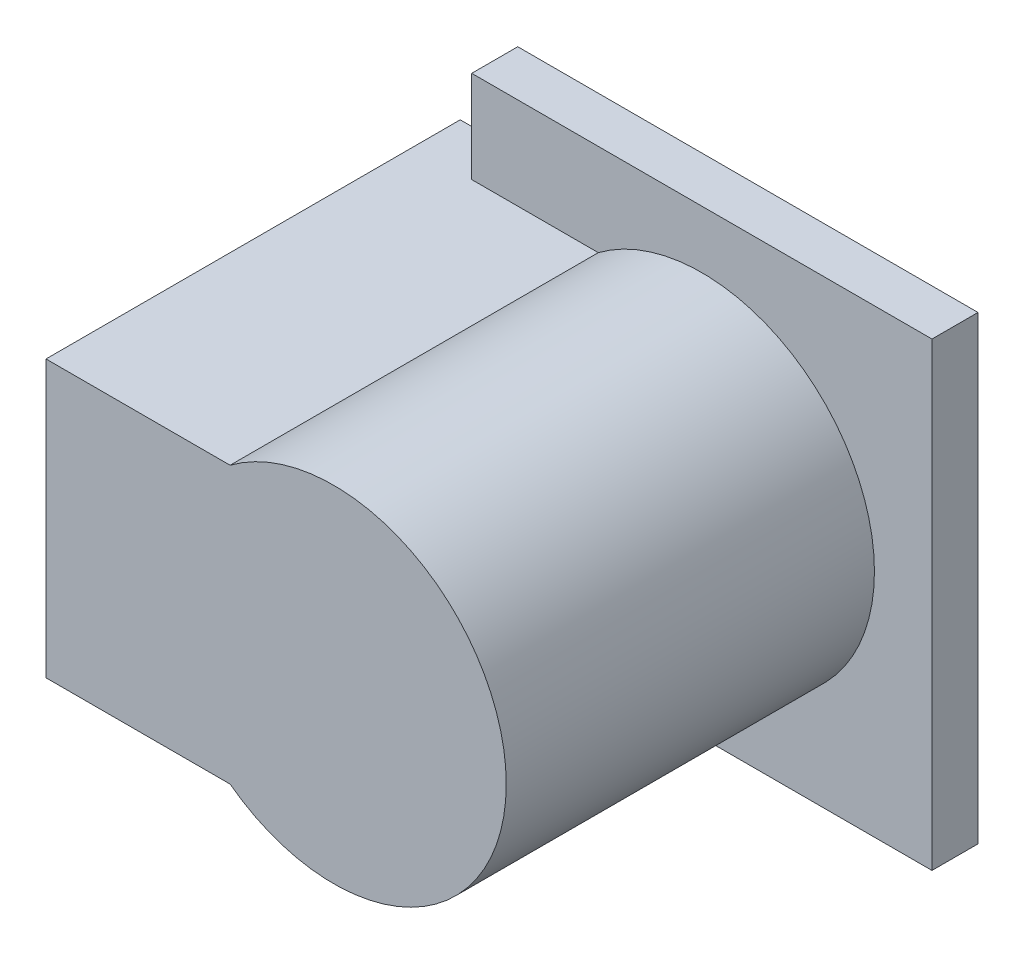
ISO-10303-21;
HEADER;
FILE_DESCRIPTION(('STEP AP214'),'2;1');
FILE_NAME('part.step','',(''),(''),'','','');
FILE_SCHEMA(('AUTOMOTIVE_DESIGN { 1 0 10303 214 1 1 1 1 }'));
ENDSEC;
DATA;
#1=APPLICATION_CONTEXT('core data for automotive mechanical design processes');
#2=APPLICATION_PROTOCOL_DEFINITION('international standard','automotive_design',2000,#1);
#3=PRODUCT_CONTEXT('',#1,'mechanical');
#4=PRODUCT('Part','Part','',(#3));
#5=PRODUCT_RELATED_PRODUCT_CATEGORY('part','',(#4));
#6=PRODUCT_DEFINITION_FORMATION('','',#4);
#7=PRODUCT_DEFINITION_CONTEXT('part definition',#1,'design');
#8=PRODUCT_DEFINITION('design','',#6,#7);
#9=PRODUCT_DEFINITION_SHAPE('','',#8);
#10=(LENGTH_UNIT() NAMED_UNIT(*) SI_UNIT(.MILLI.,.METRE.));
#11=(NAMED_UNIT(*) PLANE_ANGLE_UNIT() SI_UNIT($,.RADIAN.));
#12=(NAMED_UNIT(*) SI_UNIT($,.STERADIAN.) SOLID_ANGLE_UNIT());
#13=UNCERTAINTY_MEASURE_WITH_UNIT(LENGTH_MEASURE(1.E-05),#10,'distance_accuracy_value','');
#14=(GEOMETRIC_REPRESENTATION_CONTEXT(3) GLOBAL_UNCERTAINTY_ASSIGNED_CONTEXT((#13)) GLOBAL_UNIT_ASSIGNED_CONTEXT((#10,
#11,#12)) REPRESENTATION_CONTEXT('',''));
#15=CARTESIAN_POINT('',(0.,0.,0.));
#16=DIRECTION('',(0.,0.,1.));
#17=DIRECTION('',(1.,0.,0.));
#18=AXIS2_PLACEMENT_3D('',#15,#16,#17);
#19=CARTESIAN_POINT('',(-37.64989654809,0.,180.));
#20=DIRECTION('',(0.,0.,1.));
#21=DIRECTION('',(1.,0.,0.));
#22=AXIS2_PLACEMENT_3D('',#19,#20,#21);
#23=PLANE('',#22);
#24=CARTESIAN_POINT('',(0.,0.,180.));
#25=DIRECTION('',(0.,0.,1.));
#26=DIRECTION('',(1.,0.,0.));
#27=AXIS2_PLACEMENT_3D('',#24,#25,#26);
#28=CIRCLE('',#27,75.);
#29=CARTESIAN_POINT('',(-45.,-60.,180.));
#30=VERTEX_POINT('',#29);
#31=CARTESIAN_POINT('',(-45.,60.,180.));
#32=VERTEX_POINT('',#31);
#33=EDGE_CURVE('E11',#30,#32,#28,.T.);
#34=ORIENTED_EDGE('',*,*,#33,.T.);
#35=DIRECTION('',(-1.,0.,0.));
#36=VECTOR('',#35,1.);
#37=CARTESIAN_POINT('',(-45.,60.,180.));
#38=LINE('',#37,#36);
#39=CARTESIAN_POINT('',(-125.,60.,180.));
#40=VERTEX_POINT('',#39);
#41=EDGE_CURVE('E237',#32,#40,#38,.T.);
#42=ORIENTED_EDGE('',*,*,#41,.T.);
#43=DIRECTION('',(0.,-1.,0.));
#44=VECTOR('',#43,1.);
#45=CARTESIAN_POINT('',(-125.,60.,180.));
#46=LINE('',#45,#44);
#47=CARTESIAN_POINT('',(-125.,-60.,180.));
#48=VERTEX_POINT('',#47);
#49=EDGE_CURVE('E252',#40,#48,#46,.T.);
#50=ORIENTED_EDGE('',*,*,#49,.T.);
#51=DIRECTION('',(1.,0.,0.));
#52=VECTOR('',#51,1.);
#53=CARTESIAN_POINT('',(-125.,-60.,180.));
#54=LINE('',#53,#52);
#55=EDGE_CURVE('E226',#48,#30,#54,.T.);
#56=ORIENTED_EDGE('',*,*,#55,.T.);
#57=EDGE_LOOP('',(#34,#42,#50,#56));
#58=FACE_BOUND('',#57,.T.);
#59=ADVANCED_FACE('F19',(#58),#23,.T.);
#60=CARTESIAN_POINT('',(0.,0.,0.));
#61=DIRECTION('',(0.,0.,-1.));
#62=DIRECTION('',(1.,0.,0.));
#63=AXIS2_PLACEMENT_3D('',#60,#61,#62);
#64=CYLINDRICAL_SURFACE('',#63,75.);
#65=DIRECTION('',(0.,0.,1.));
#66=VECTOR('',#65,1.);
#67=CARTESIAN_POINT('',(-45.,60.,0.));
#68=LINE('',#67,#66);
#69=CARTESIAN_POINT('',(-45.,60.,20.));
#70=VERTEX_POINT('',#69);
#71=EDGE_CURVE('E203',#70,#32,#68,.T.);
#72=ORIENTED_EDGE('',*,*,#71,.T.);
#73=ORIENTED_EDGE('',*,*,#33,.F.);
#74=DIRECTION('',(0.,0.,1.));
#75=VECTOR('',#74,1.);
#76=CARTESIAN_POINT('',(-45.,-60.,0.));
#77=LINE('',#76,#75);
#78=CARTESIAN_POINT('',(-45.,-60.,20.));
#79=VERTEX_POINT('',#78);
#80=EDGE_CURVE('E222',#79,#30,#77,.T.);
#81=ORIENTED_EDGE('',*,*,#80,.F.);
#82=CARTESIAN_POINT('',(0.,0.,20.));
#83=DIRECTION('',(0.,0.,-1.));
#84=DIRECTION('',(1.,0.,0.));
#85=AXIS2_PLACEMENT_3D('',#82,#83,#84);
#86=CIRCLE('',#85,75.);
#87=EDGE_CURVE('E30',#70,#79,#86,.T.);
#88=ORIENTED_EDGE('',*,*,#87,.F.);
#89=EDGE_LOOP('',(#72,#73,#81,#88));
#90=FACE_BOUND('',#89,.T.);
#91=ADVANCED_FACE('F279',(#90),#64,.T.);
#92=CARTESIAN_POINT('',(0.,0.,20.));
#93=DIRECTION('',(0.,0.,-1.));
#94=DIRECTION('',(0.,-1.,0.));
#95=AXIS2_PLACEMENT_3D('',#92,#93,#94);
#96=PLANE('',#95);
#97=DIRECTION('',(1.,0.,0.));
#98=VECTOR('',#97,1.);
#99=CARTESIAN_POINT('',(-22.5,60.,20.));
#100=LINE('',#99,#98);
#101=CARTESIAN_POINT('',(-100.,60.,20.));
#102=VERTEX_POINT('',#101);
#103=EDGE_CURVE('E241',#102,#70,#100,.T.);
#104=ORIENTED_EDGE('',*,*,#103,.T.);
#105=ORIENTED_EDGE('',*,*,#87,.T.);
#106=DIRECTION('',(-1.,0.,0.));
#107=VECTOR('',#106,1.);
#108=CARTESIAN_POINT('',(-62.5,-60.,20.));
#109=LINE('',#108,#107);
#110=CARTESIAN_POINT('',(-100.,-60.,20.));
#111=VERTEX_POINT('',#110);
#112=EDGE_CURVE('E116',#79,#111,#109,.T.);
#113=ORIENTED_EDGE('',*,*,#112,.T.);
#114=DIRECTION('',(0.,1.,0.));
#115=VECTOR('',#114,1.);
#116=CARTESIAN_POINT('',(-100.,-100.,20.));
#117=LINE('',#116,#115);
#118=CARTESIAN_POINT('',(-100.,-100.,20.));
#119=VERTEX_POINT('',#118);
#120=EDGE_CURVE('E157',#119,#111,#117,.T.);
#121=ORIENTED_EDGE('',*,*,#120,.F.);
#122=DIRECTION('',(-1.,0.,0.));
#123=VECTOR('',#122,1.);
#124=CARTESIAN_POINT('',(100.,-100.,20.));
#125=LINE('',#124,#123);
#126=CARTESIAN_POINT('',(100.,-100.,20.));
#127=VERTEX_POINT('',#126);
#128=EDGE_CURVE('E123',#127,#119,#125,.T.);
#129=ORIENTED_EDGE('',*,*,#128,.F.);
#130=DIRECTION('',(0.,-1.,0.));
#131=VECTOR('',#130,1.);
#132=CARTESIAN_POINT('',(100.,100.,20.));
#133=LINE('',#132,#131);
#134=CARTESIAN_POINT('',(100.,100.,20.));
#135=VERTEX_POINT('',#134);
#136=EDGE_CURVE('E256',#135,#127,#133,.T.);
#137=ORIENTED_EDGE('',*,*,#136,.F.);
#138=DIRECTION('',(1.,0.,0.));
#139=VECTOR('',#138,1.);
#140=CARTESIAN_POINT('',(-100.,100.,20.));
#141=LINE('',#140,#139);
#142=CARTESIAN_POINT('',(-100.,100.,20.));
#143=VERTEX_POINT('',#142);
#144=EDGE_CURVE('E223',#143,#135,#141,.T.);
#145=ORIENTED_EDGE('',*,*,#144,.F.);
#146=DIRECTION('',(0.,1.,0.));
#147=VECTOR('',#146,1.);
#148=CARTESIAN_POINT('',(-100.,-100.,20.));
#149=LINE('',#148,#147);
#150=EDGE_CURVE('E210',#102,#143,#149,.T.);
#151=ORIENTED_EDGE('',*,*,#150,.F.);
#152=EDGE_LOOP('',(#104,#105,#113,#121,#129,#137,#145,#151));
#153=FACE_BOUND('',#152,.T.);
#154=ADVANCED_FACE('F301',(#153),#96,.F.);
#155=CARTESIAN_POINT('',(-45.,60.,0.));
#156=DIRECTION('',(0.,-1.,0.));
#157=DIRECTION('',(0.,0.,-1.));
#158=AXIS2_PLACEMENT_3D('',#155,#156,#157);
#159=PLANE('',#158);
#160=DIRECTION('',(0.,0.,-1.));
#161=VECTOR('',#160,1.);
#162=CARTESIAN_POINT('',(-100.,60.,0.));
#163=LINE('',#162,#161);
#164=CARTESIAN_POINT('',(-100.,60.,0.));
#165=VERTEX_POINT('',#164);
#166=EDGE_CURVE('E145',#102,#165,#163,.T.);
#167=ORIENTED_EDGE('',*,*,#166,.T.);
#168=DIRECTION('',(-1.,0.,0.));
#169=VECTOR('',#168,1.);
#170=CARTESIAN_POINT('',(-45.,60.,0.));
#171=LINE('',#170,#169);
#172=CARTESIAN_POINT('',(-125.,60.,0.));
#173=VERTEX_POINT('',#172);
#174=EDGE_CURVE('E171',#165,#173,#171,.T.);
#175=ORIENTED_EDGE('',*,*,#174,.T.);
#176=DIRECTION('',(0.,0.,1.));
#177=VECTOR('',#176,1.);
#178=CARTESIAN_POINT('',(-125.,60.,0.));
#179=LINE('',#178,#177);
#180=EDGE_CURVE('E239',#173,#40,#179,.T.);
#181=ORIENTED_EDGE('',*,*,#180,.T.);
#182=ORIENTED_EDGE('',*,*,#41,.F.);
#183=ORIENTED_EDGE('',*,*,#71,.F.);
#184=ORIENTED_EDGE('',*,*,#103,.F.);
#185=EDGE_LOOP('',(#167,#175,#181,#182,#183,#184));
#186=FACE_BOUND('',#185,.T.);
#187=ADVANCED_FACE('F306',(#186),#159,.F.);
#188=CARTESIAN_POINT('',(-125.,60.,0.));
#189=DIRECTION('',(1.,0.,0.));
#190=DIRECTION('',(0.,1.,0.));
#191=AXIS2_PLACEMENT_3D('',#188,#189,#190);
#192=PLANE('',#191);
#193=DIRECTION('',(0.,-1.,0.));
#194=VECTOR('',#193,1.);
#195=CARTESIAN_POINT('',(-125.,60.,0.));
#196=LINE('',#195,#194);
#197=CARTESIAN_POINT('',(-125.,-60.,0.));
#198=VERTEX_POINT('',#197);
#199=EDGE_CURVE('E182',#173,#198,#196,.T.);
#200=ORIENTED_EDGE('',*,*,#199,.T.);
#201=DIRECTION('',(0.,0.,1.));
#202=VECTOR('',#201,1.);
#203=CARTESIAN_POINT('',(-125.,-60.,0.));
#204=LINE('',#203,#202);
#205=EDGE_CURVE('E23',#198,#48,#204,.T.);
#206=ORIENTED_EDGE('',*,*,#205,.T.);
#207=ORIENTED_EDGE('',*,*,#49,.F.);
#208=ORIENTED_EDGE('',*,*,#180,.F.);
#209=EDGE_LOOP('',(#200,#206,#207,#208));
#210=FACE_BOUND('',#209,.T.);
#211=ADVANCED_FACE('F286',(#210),#192,.F.);
#212=CARTESIAN_POINT('',(-125.,-60.,0.));
#213=DIRECTION('',(0.,1.,0.));
#214=DIRECTION('',(1.,0.,0.));
#215=AXIS2_PLACEMENT_3D('',#212,#213,#214);
#216=PLANE('',#215);
#217=DIRECTION('',(0.,0.,1.));
#218=VECTOR('',#217,1.);
#219=CARTESIAN_POINT('',(-100.,-60.,0.));
#220=LINE('',#219,#218);
#221=CARTESIAN_POINT('',(-100.,-60.,0.));
#222=VERTEX_POINT('',#221);
#223=EDGE_CURVE('E151',#222,#111,#220,.T.);
#224=ORIENTED_EDGE('',*,*,#223,.T.);
#225=ORIENTED_EDGE('',*,*,#112,.F.);
#226=ORIENTED_EDGE('',*,*,#80,.T.);
#227=ORIENTED_EDGE('',*,*,#55,.F.);
#228=ORIENTED_EDGE('',*,*,#205,.F.);
#229=DIRECTION('',(1.,0.,0.));
#230=VECTOR('',#229,1.);
#231=CARTESIAN_POINT('',(-125.,-60.,0.));
#232=LINE('',#231,#230);
#233=EDGE_CURVE('E162',#198,#222,#232,.T.);
#234=ORIENTED_EDGE('',*,*,#233,.T.);
#235=EDGE_LOOP('',(#224,#225,#226,#227,#228,#234));
#236=FACE_BOUND('',#235,.T.);
#237=ADVANCED_FACE('F163',(#236),#216,.F.);
#238=CARTESIAN_POINT('',(-100.,100.,0.));
#239=DIRECTION('',(0.,1.,0.));
#240=DIRECTION('',(1.,0.,0.));
#241=AXIS2_PLACEMENT_3D('',#238,#239,#240);
#242=PLANE('',#241);
#243=DIRECTION('',(0.,0.,1.));
#244=VECTOR('',#243,1.);
#245=CARTESIAN_POINT('',(-100.,100.,0.));
#246=LINE('',#245,#244);
#247=CARTESIAN_POINT('',(-100.,100.,0.));
#248=VERTEX_POINT('',#247);
#249=EDGE_CURVE('E214',#248,#143,#246,.T.);
#250=ORIENTED_EDGE('',*,*,#249,.T.);
#251=ORIENTED_EDGE('',*,*,#144,.T.);
#252=DIRECTION('',(0.,0.,1.));
#253=VECTOR('',#252,1.);
#254=CARTESIAN_POINT('',(100.,100.,0.));
#255=LINE('',#254,#253);
#256=CARTESIAN_POINT('',(100.,100.,0.));
#257=VERTEX_POINT('',#256);
#258=EDGE_CURVE('E235',#257,#135,#255,.T.);
#259=ORIENTED_EDGE('',*,*,#258,.F.);
#260=DIRECTION('',(1.,0.,0.));
#261=VECTOR('',#260,1.);
#262=CARTESIAN_POINT('',(-100.,100.,0.));
#263=LINE('',#262,#261);
#264=EDGE_CURVE('E209',#248,#257,#263,.T.);
#265=ORIENTED_EDGE('',*,*,#264,.F.);
#266=EDGE_LOOP('',(#250,#251,#259,#265));
#267=FACE_BOUND('',#266,.T.);
#268=ADVANCED_FACE('F350',(#267),#242,.T.);
#269=CARTESIAN_POINT('',(100.,100.,0.));
#270=DIRECTION('',(1.,0.,0.));
#271=DIRECTION('',(0.,1.,0.));
#272=AXIS2_PLACEMENT_3D('',#269,#270,#271);
#273=PLANE('',#272);
#274=ORIENTED_EDGE('',*,*,#258,.T.);
#275=ORIENTED_EDGE('',*,*,#136,.T.);
#276=DIRECTION('',(0.,0.,1.));
#277=VECTOR('',#276,1.);
#278=CARTESIAN_POINT('',(100.,-100.,0.));
#279=LINE('',#278,#277);
#280=CARTESIAN_POINT('',(100.,-100.,0.));
#281=VERTEX_POINT('',#280);
#282=EDGE_CURVE('E103',#281,#127,#279,.T.);
#283=ORIENTED_EDGE('',*,*,#282,.F.);
#284=DIRECTION('',(0.,-1.,0.));
#285=VECTOR('',#284,1.);
#286=CARTESIAN_POINT('',(100.,100.,0.));
#287=LINE('',#286,#285);
#288=EDGE_CURVE('E206',#257,#281,#287,.T.);
#289=ORIENTED_EDGE('',*,*,#288,.F.);
#290=EDGE_LOOP('',(#274,#275,#283,#289));
#291=FACE_BOUND('',#290,.T.);
#292=ADVANCED_FACE('F344',(#291),#273,.T.);
#293=CARTESIAN_POINT('',(100.,-100.,0.));
#294=DIRECTION('',(0.,-1.,0.));
#295=DIRECTION('',(0.,0.,-1.));
#296=AXIS2_PLACEMENT_3D('',#293,#294,#295);
#297=PLANE('',#296);
#298=ORIENTED_EDGE('',*,*,#282,.T.);
#299=ORIENTED_EDGE('',*,*,#128,.T.);
#300=DIRECTION('',(0.,0.,1.));
#301=VECTOR('',#300,1.);
#302=CARTESIAN_POINT('',(-100.,-100.,0.));
#303=LINE('',#302,#301);
#304=CARTESIAN_POINT('',(-100.,-100.,0.));
#305=VERTEX_POINT('',#304);
#306=EDGE_CURVE('E91',#305,#119,#303,.T.);
#307=ORIENTED_EDGE('',*,*,#306,.F.);
#308=DIRECTION('',(-1.,0.,0.));
#309=VECTOR('',#308,1.);
#310=CARTESIAN_POINT('',(100.,-100.,0.));
#311=LINE('',#310,#309);
#312=EDGE_CURVE('E180',#281,#305,#311,.T.);
#313=ORIENTED_EDGE('',*,*,#312,.F.);
#314=EDGE_LOOP('',(#298,#299,#307,#313));
#315=FACE_BOUND('',#314,.T.);
#316=ADVANCED_FACE('F349',(#315),#297,.T.);
#317=CARTESIAN_POINT('',(-100.,-100.,0.));
#318=DIRECTION('',(-1.,0.,0.));
#319=DIRECTION('',(0.,0.,1.));
#320=AXIS2_PLACEMENT_3D('',#317,#318,#319);
#321=PLANE('',#320);
#322=DIRECTION('',(0.,1.,0.));
#323=VECTOR('',#322,1.);
#324=CARTESIAN_POINT('',(-100.,-100.,0.));
#325=LINE('',#324,#323);
#326=EDGE_CURVE('E155',#305,#222,#325,.T.);
#327=ORIENTED_EDGE('',*,*,#326,.F.);
#328=ORIENTED_EDGE('',*,*,#306,.T.);
#329=ORIENTED_EDGE('',*,*,#120,.T.);
#330=ORIENTED_EDGE('',*,*,#223,.F.);
#331=EDGE_LOOP('',(#327,#328,#329,#330));
#332=FACE_BOUND('',#331,.T.);
#333=ADVANCED_FACE('F153',(#332),#321,.T.);
#334=CARTESIAN_POINT('',(-100.,-100.,0.));
#335=DIRECTION('',(-1.,0.,0.));
#336=DIRECTION('',(0.,0.,1.));
#337=AXIS2_PLACEMENT_3D('',#334,#335,#336);
#338=PLANE('',#337);
#339=DIRECTION('',(0.,1.,0.));
#340=VECTOR('',#339,1.);
#341=CARTESIAN_POINT('',(-100.,-100.,0.));
#342=LINE('',#341,#340);
#343=EDGE_CURVE('E190',#165,#248,#342,.T.);
#344=ORIENTED_EDGE('',*,*,#343,.F.);
#345=ORIENTED_EDGE('',*,*,#166,.F.);
#346=ORIENTED_EDGE('',*,*,#150,.T.);
#347=ORIENTED_EDGE('',*,*,#249,.F.);
#348=EDGE_LOOP('',(#344,#345,#346,#347));
#349=FACE_BOUND('',#348,.T.);
#350=ADVANCED_FACE('F293',(#349),#338,.T.);
#351=CARTESIAN_POINT('',(-37.64989654809,0.,0.));
#352=DIRECTION('',(0.,0.,1.));
#353=DIRECTION('',(1.,0.,0.));
#354=AXIS2_PLACEMENT_3D('',#351,#352,#353);
#355=PLANE('',#354);
#356=ORIENTED_EDGE('',*,*,#199,.F.);
#357=ORIENTED_EDGE('',*,*,#174,.F.);
#358=DIRECTION('',(0.,1.,0.));
#359=VECTOR('',#358,1.);
#360=CARTESIAN_POINT('',(-100.,-100.,0.));
#361=LINE('',#360,#359);
#362=EDGE_CURVE('E187',#222,#165,#361,.T.);
#363=ORIENTED_EDGE('',*,*,#362,.F.);
#364=ORIENTED_EDGE('',*,*,#233,.F.);
#365=EDGE_LOOP('',(#356,#357,#363,#364));
#366=FACE_BOUND('',#365,.T.);
#367=ADVANCED_FACE('F192',(#366),#355,.F.);
#368=CARTESIAN_POINT('',(0.,0.,0.));
#369=DIRECTION('',(0.,0.,-1.));
#370=DIRECTION('',(0.,-1.,0.));
#371=AXIS2_PLACEMENT_3D('',#368,#369,#370);
#372=PLANE('',#371);
#373=ORIENTED_EDGE('',*,*,#343,.T.);
#374=ORIENTED_EDGE('',*,*,#264,.T.);
#375=ORIENTED_EDGE('',*,*,#288,.T.);
#376=ORIENTED_EDGE('',*,*,#312,.T.);
#377=ORIENTED_EDGE('',*,*,#326,.T.);
#378=DIRECTION('',(1.,0.,0.));
#379=VECTOR('',#378,1.);
#380=CARTESIAN_POINT('',(-125.,-60.,0.));
#381=LINE('',#380,#379);
#382=CARTESIAN_POINT('',(-45.,-60.,0.));
#383=VERTEX_POINT('',#382);
#384=EDGE_CURVE('E177',#222,#383,#381,.T.);
#385=ORIENTED_EDGE('',*,*,#384,.T.);
#386=CARTESIAN_POINT('',(0.,0.,0.));
#387=DIRECTION('',(0.,0.,1.));
#388=DIRECTION('',(1.,0.,0.));
#389=AXIS2_PLACEMENT_3D('',#386,#387,#388);
#390=CIRCLE('',#389,75.);
#391=CARTESIAN_POINT('',(-45.,60.,0.));
#392=VERTEX_POINT('',#391);
#393=EDGE_CURVE('E188',#383,#392,#390,.T.);
#394=ORIENTED_EDGE('',*,*,#393,.T.);
#395=DIRECTION('',(-1.,0.,0.));
#396=VECTOR('',#395,1.);
#397=CARTESIAN_POINT('',(-45.,60.,0.));
#398=LINE('',#397,#396);
#399=EDGE_CURVE('E195',#392,#165,#398,.T.);
#400=ORIENTED_EDGE('',*,*,#399,.T.);
#401=EDGE_LOOP('',(#373,#374,#375,#376,#377,#385,#394,#400));
#402=FACE_BOUND('',#401,.T.);
#403=ADVANCED_FACE('F176',(#402),#372,.T.);
#404=CARTESIAN_POINT('',(-37.64989654809,0.,0.));
#405=DIRECTION('',(0.,0.,1.));
#406=DIRECTION('',(1.,0.,0.));
#407=AXIS2_PLACEMENT_3D('',#404,#405,#406);
#408=PLANE('',#407);
#409=ORIENTED_EDGE('',*,*,#362,.T.);
#410=ORIENTED_EDGE('',*,*,#399,.F.);
#411=ORIENTED_EDGE('',*,*,#393,.F.);
#412=ORIENTED_EDGE('',*,*,#384,.F.);
#413=EDGE_LOOP('',(#409,#410,#411,#412));
#414=FACE_BOUND('',#413,.T.);
#415=ADVANCED_FACE('F21',(#414),#408,.F.);
#416=CLOSED_SHELL('',(#59,#91,#154,#187,#211,#237,#268,#292,#316,#333,#350,#367,#403,#415));
#417=MANIFOLD_SOLID_BREP('B1',#416);
#418=ADVANCED_BREP_SHAPE_REPRESENTATION('',(#18,#417),#14);
#419=SHAPE_DEFINITION_REPRESENTATION(#9,#418);
ENDSEC;
END-ISO-10303-21;
